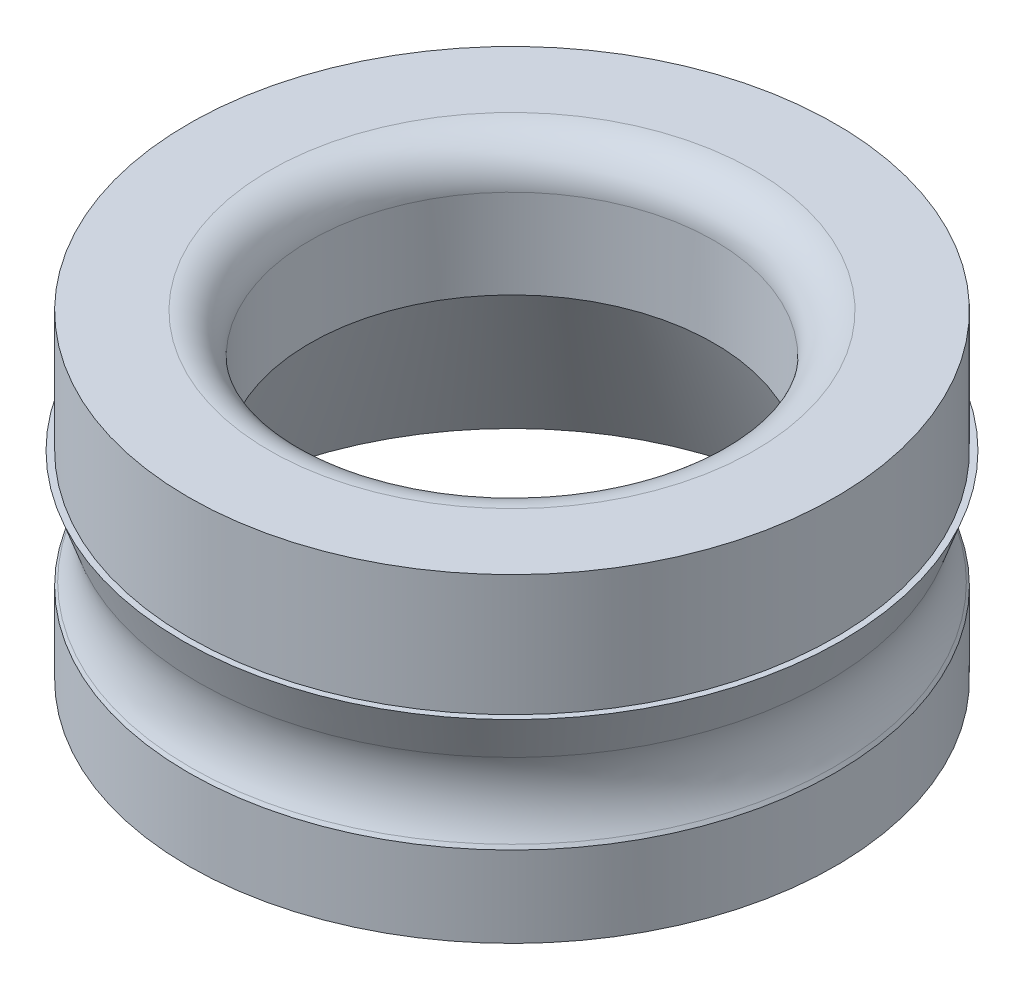
ISO-10303-21;
HEADER;
FILE_DESCRIPTION(('STEP AP214'),'2;1');
FILE_NAME('part.step','',(''),(''),'','','');
FILE_SCHEMA(('AUTOMOTIVE_DESIGN { 1 0 10303 214 1 1 1 1 }'));
ENDSEC;
DATA;
#1=APPLICATION_CONTEXT('core data for automotive mechanical design processes');
#2=APPLICATION_PROTOCOL_DEFINITION('international standard','automotive_design',2000,#1);
#3=PRODUCT_CONTEXT('',#1,'mechanical');
#4=PRODUCT('Part','Part','',(#3));
#5=PRODUCT_RELATED_PRODUCT_CATEGORY('part','',(#4));
#6=PRODUCT_DEFINITION_FORMATION('','',#4);
#7=PRODUCT_DEFINITION_CONTEXT('part definition',#1,'design');
#8=PRODUCT_DEFINITION('design','',#6,#7);
#9=PRODUCT_DEFINITION_SHAPE('','',#8);
#10=(LENGTH_UNIT() NAMED_UNIT(*) SI_UNIT(.MILLI.,.METRE.));
#11=(NAMED_UNIT(*) PLANE_ANGLE_UNIT() SI_UNIT($,.RADIAN.));
#12=(NAMED_UNIT(*) SI_UNIT($,.STERADIAN.) SOLID_ANGLE_UNIT());
#13=UNCERTAINTY_MEASURE_WITH_UNIT(LENGTH_MEASURE(1.E-05),#10,'distance_accuracy_value','');
#14=(GEOMETRIC_REPRESENTATION_CONTEXT(3) GLOBAL_UNCERTAINTY_ASSIGNED_CONTEXT((#13)) GLOBAL_UNIT_ASSIGNED_CONTEXT((#10,
#11,#12)) REPRESENTATION_CONTEXT('',''));
#15=CARTESIAN_POINT('',(0.,0.,0.));
#16=DIRECTION('',(0.,0.,1.));
#17=DIRECTION('',(1.,0.,0.));
#18=AXIS2_PLACEMENT_3D('',#15,#16,#17);
#19=CARTESIAN_POINT('',(0.,0.,0.));
#20=DIRECTION('',(0.,1.,0.));
#21=DIRECTION('',(0.,0.,1.));
#22=AXIS2_PLACEMENT_3D('',#19,#20,#21);
#23=CYLINDRICAL_SURFACE('',#22,2.5);
#24=CARTESIAN_POINT('',(0.,-0.5,0.));
#25=DIRECTION('',(0.,-1.,0.));
#26=DIRECTION('',(0.,0.,-1.));
#27=AXIS2_PLACEMENT_3D('',#24,#25,#26);
#28=CIRCLE('',#27,2.5);
#29=CARTESIAN_POINT('',(0.,-0.5,-2.5));
#30=VERTEX_POINT('',#29);
#31=EDGE_CURVE('E21',#30,#30,#28,.F.);
#32=ORIENTED_EDGE('',*,*,#31,.T.);
#33=EDGE_LOOP('',(#32));
#34=FACE_BOUND('',#33,.T.);
#35=CARTESIAN_POINT('',(0.,-1.6,0.));
#36=DIRECTION('',(0.,1.,0.));
#37=DIRECTION('',(0.,0.,1.));
#38=AXIS2_PLACEMENT_3D('',#35,#36,#37);
#39=CIRCLE('',#38,2.5);
#40=CARTESIAN_POINT('',(0.,-1.6,2.5));
#41=VERTEX_POINT('',#40);
#42=EDGE_CURVE('E56',#41,#41,#39,.T.);
#43=ORIENTED_EDGE('',*,*,#42,.F.);
#44=EDGE_LOOP('',(#43));
#45=FACE_BOUND('',#44,.T.);
#46=ADVANCED_FACE('F14',(#34,#45),#23,.F.);
#47=CARTESIAN_POINT('',(2.5,0.,0.));
#48=DIRECTION('',(0.,-1.,0.));
#49=DIRECTION('',(0.,0.,-1.));
#50=AXIS2_PLACEMENT_3D('',#47,#48,#49);
#51=PLANE('',#50);
#52=CARTESIAN_POINT('',(0.,0.,0.));
#53=DIRECTION('',(0.,-1.,0.));
#54=DIRECTION('',(0.,0.,-1.));
#55=AXIS2_PLACEMENT_3D('',#52,#53,#54);
#56=CIRCLE('',#55,3.);
#57=CARTESIAN_POINT('',(0.,0.,-3.));
#58=VERTEX_POINT('',#57);
#59=EDGE_CURVE('E10',#58,#58,#56,.T.);
#60=ORIENTED_EDGE('',*,*,#59,.T.);
#61=EDGE_LOOP('',(#60));
#62=FACE_BOUND('',#61,.T.);
#63=CARTESIAN_POINT('',(0.,0.,0.));
#64=DIRECTION('',(0.,1.,0.));
#65=DIRECTION('',(0.,0.,1.));
#66=AXIS2_PLACEMENT_3D('',#63,#64,#65);
#67=CIRCLE('',#66,4.);
#68=CARTESIAN_POINT('',(0.,0.,4.));
#69=VERTEX_POINT('',#68);
#70=EDGE_CURVE('E34',#69,#69,#67,.T.);
#71=ORIENTED_EDGE('',*,*,#70,.T.);
#72=EDGE_LOOP('',(#71));
#73=FACE_BOUND('',#72,.T.);
#74=ADVANCED_FACE('F66',(#62,#73),#51,.F.);
#75=CARTESIAN_POINT('',(0.,0.,0.));
#76=DIRECTION('',(0.,1.,0.));
#77=DIRECTION('',(0.,0.,1.));
#78=AXIS2_PLACEMENT_3D('',#75,#76,#77);
#79=CYLINDRICAL_SURFACE('',#78,4.);
#80=ORIENTED_EDGE('',*,*,#70,.F.);
#81=EDGE_LOOP('',(#80));
#82=FACE_BOUND('',#81,.T.);
#83=CARTESIAN_POINT('',(0.,-1.5,0.));
#84=DIRECTION('',(0.,1.,0.));
#85=DIRECTION('',(0.,0.,1.));
#86=AXIS2_PLACEMENT_3D('',#83,#84,#85);
#87=CIRCLE('',#86,4.);
#88=CARTESIAN_POINT('',(0.,-1.5,4.));
#89=VERTEX_POINT('',#88);
#90=EDGE_CURVE('E37',#89,#89,#87,.T.);
#91=ORIENTED_EDGE('',*,*,#90,.T.);
#92=EDGE_LOOP('',(#91));
#93=FACE_BOUND('',#92,.T.);
#94=ADVANCED_FACE('F72',(#82,#93),#79,.T.);
#95=CARTESIAN_POINT('',(4.,-1.5,0.));
#96=DIRECTION('',(0.,-1.,0.));
#97=DIRECTION('',(0.,0.,-1.));
#98=AXIS2_PLACEMENT_3D('',#95,#96,#97);
#99=PLANE('',#98);
#100=ORIENTED_EDGE('',*,*,#90,.F.);
#101=EDGE_LOOP('',(#100));
#102=FACE_BOUND('',#101,.T.);
#103=CARTESIAN_POINT('',(0.,-1.5,0.));
#104=DIRECTION('',(0.,1.,0.));
#105=DIRECTION('',(0.,0.,1.));
#106=AXIS2_PLACEMENT_3D('',#103,#104,#105);
#107=CIRCLE('',#106,4.075);
#108=CARTESIAN_POINT('',(0.,-1.5,4.075));
#109=VERTEX_POINT('',#108);
#110=EDGE_CURVE('E40',#109,#109,#107,.T.);
#111=ORIENTED_EDGE('',*,*,#110,.T.);
#112=EDGE_LOOP('',(#111));
#113=FACE_BOUND('',#112,.T.);
#114=ADVANCED_FACE('F94',(#102,#113),#99,.F.);
#115=CARTESIAN_POINT('',(0.,-2.49698119094872,0.));
#116=DIRECTION('',(0.,1.,0.));
#117=DIRECTION('',(0.,0.,1.));
#118=AXIS2_PLACEMENT_3D('',#115,#116,#117);
#119=CONICAL_SURFACE('',#118,3.71833235537383,0.343560185198722);
#120=CARTESIAN_POINT('',(0.,-2.04225730658908,0.));
#121=DIRECTION('',(0.,1.,0.));
#122=DIRECTION('',(0.,0.,1.));
#123=AXIS2_PLACEMENT_3D('',#120,#121,#122);
#124=CIRCLE('',#123,3.88100874110934);
#125=CARTESIAN_POINT('',(0.,-2.04225730658908,3.88100874110934));
#126=VERTEX_POINT('',#125);
#127=EDGE_CURVE('E29',#126,#126,#124,.T.);
#128=ORIENTED_EDGE('',*,*,#127,.T.);
#129=EDGE_LOOP('',(#128));
#130=FACE_BOUND('',#129,.T.);
#131=ORIENTED_EDGE('',*,*,#110,.F.);
#132=EDGE_LOOP('',(#131));
#133=FACE_BOUND('',#132,.T.);
#134=ADVANCED_FACE('F90',(#130,#133),#119,.T.);
#135=CARTESIAN_POINT('',(0.,-2.95,0.));
#136=DIRECTION('',(0.,-1.,0.));
#137=DIRECTION('',(0.,0.,-1.));
#138=AXIS2_PLACEMENT_3D('',#135,#136,#137);
#139=CONICAL_SURFACE('',#138,4.,0.55626391677816);
#140=CARTESIAN_POINT('',(0.,-2.90711574183858,0.));
#141=DIRECTION('',(0.,-1.,0.));
#142=DIRECTION('',(0.,0.,-1.));
#143=AXIS2_PLACEMENT_3D('',#140,#141,#142);
#144=CIRCLE('',#143,3.97333640955624);
#145=CARTESIAN_POINT('',(0.,-2.90711574183858,-3.97333640955624));
#146=VERTEX_POINT('',#145);
#147=EDGE_CURVE('E25',#146,#146,#144,.T.);
#148=ORIENTED_EDGE('',*,*,#147,.T.);
#149=EDGE_LOOP('',(#148));
#150=FACE_BOUND('',#149,.T.);
#151=CARTESIAN_POINT('',(0.,-2.95,0.));
#152=DIRECTION('',(0.,1.,0.));
#153=DIRECTION('',(0.,0.,1.));
#154=AXIS2_PLACEMENT_3D('',#151,#152,#153);
#155=CIRCLE('',#154,4.);
#156=CARTESIAN_POINT('',(0.,-2.95,4.));
#157=VERTEX_POINT('',#156);
#158=EDGE_CURVE('E43',#157,#157,#155,.T.);
#159=ORIENTED_EDGE('',*,*,#158,.T.);
#160=EDGE_LOOP('',(#159));
#161=FACE_BOUND('',#160,.T.);
#162=ADVANCED_FACE('F93',(#150,#161),#139,.T.);
#163=CARTESIAN_POINT('',(0.,0.,0.));
#164=DIRECTION('',(0.,1.,0.));
#165=DIRECTION('',(0.,0.,1.));
#166=AXIS2_PLACEMENT_3D('',#163,#164,#165);
#167=CYLINDRICAL_SURFACE('',#166,4.);
#168=ORIENTED_EDGE('',*,*,#158,.F.);
#169=EDGE_LOOP('',(#168));
#170=FACE_BOUND('',#169,.T.);
#171=CARTESIAN_POINT('',(0.,-3.95,0.));
#172=DIRECTION('',(0.,1.,0.));
#173=DIRECTION('',(0.,0.,1.));
#174=AXIS2_PLACEMENT_3D('',#171,#172,#173);
#175=CIRCLE('',#174,4.);
#176=CARTESIAN_POINT('',(0.,-3.95,4.));
#177=VERTEX_POINT('',#176);
#178=EDGE_CURVE('E47',#177,#177,#175,.T.);
#179=ORIENTED_EDGE('',*,*,#178,.T.);
#180=EDGE_LOOP('',(#179));
#181=FACE_BOUND('',#180,.T.);
#182=ADVANCED_FACE('F109',(#170,#181),#167,.T.);
#183=CARTESIAN_POINT('',(4.,-3.95,0.));
#184=DIRECTION('',(0.,1.,0.));
#185=DIRECTION('',(0.,0.,1.));
#186=AXIS2_PLACEMENT_3D('',#183,#184,#185);
#187=PLANE('',#186);
#188=ORIENTED_EDGE('',*,*,#178,.F.);
#189=EDGE_LOOP('',(#188));
#190=FACE_BOUND('',#189,.T.);
#191=CARTESIAN_POINT('',(0.,-3.95,0.));
#192=DIRECTION('',(0.,1.,0.));
#193=DIRECTION('',(0.,0.,1.));
#194=AXIS2_PLACEMENT_3D('',#191,#192,#193);
#195=CIRCLE('',#194,3.8);
#196=CARTESIAN_POINT('',(0.,-3.95,3.8));
#197=VERTEX_POINT('',#196);
#198=EDGE_CURVE('E50',#197,#197,#195,.T.);
#199=ORIENTED_EDGE('',*,*,#198,.T.);
#200=EDGE_LOOP('',(#199));
#201=FACE_BOUND('',#200,.T.);
#202=ADVANCED_FACE('F113',(#190,#201),#187,.F.);
#203=CARTESIAN_POINT('',(0.,-1.6,0.));
#204=DIRECTION('',(0.,-1.,0.));
#205=DIRECTION('',(0.,0.,-1.));
#206=AXIS2_PLACEMENT_3D('',#203,#204,#205);
#207=CONICAL_SURFACE('',#206,2.75,0.420196713609275);
#208=ORIENTED_EDGE('',*,*,#198,.F.);
#209=EDGE_LOOP('',(#208));
#210=FACE_BOUND('',#209,.T.);
#211=CARTESIAN_POINT('',(0.,-1.6,0.));
#212=DIRECTION('',(0.,1.,0.));
#213=DIRECTION('',(0.,0.,1.));
#214=AXIS2_PLACEMENT_3D('',#211,#212,#213);
#215=CIRCLE('',#214,2.75);
#216=CARTESIAN_POINT('',(0.,-1.6,2.75));
#217=VERTEX_POINT('',#216);
#218=EDGE_CURVE('E53',#217,#217,#215,.T.);
#219=ORIENTED_EDGE('',*,*,#218,.T.);
#220=EDGE_LOOP('',(#219));
#221=FACE_BOUND('',#220,.T.);
#222=ADVANCED_FACE('F83',(#210,#221),#207,.F.);
#223=CARTESIAN_POINT('',(2.75,-1.6,0.));
#224=DIRECTION('',(0.,1.,0.));
#225=DIRECTION('',(0.,0.,1.));
#226=AXIS2_PLACEMENT_3D('',#223,#224,#225);
#227=PLANE('',#226);
#228=ORIENTED_EDGE('',*,*,#218,.F.);
#229=EDGE_LOOP('',(#228));
#230=FACE_BOUND('',#229,.T.);
#231=ORIENTED_EDGE('',*,*,#42,.T.);
#232=EDGE_LOOP('',(#231));
#233=FACE_BOUND('',#232,.T.);
#234=ADVANCED_FACE('F63',(#230,#233),#227,.F.);
#235=CARTESIAN_POINT('',(0.,-2.37909865938718,0.));
#236=DIRECTION('',(0.,1.,0.));
#237=DIRECTION('',(0.,0.,1.));
#238=AXIS2_PLACEMENT_3D('',#235,#236,#237);
#239=TOROIDAL_SURFACE('',#238,4.82257015867335,1.);
#240=ORIENTED_EDGE('',*,*,#147,.F.);
#241=EDGE_LOOP('',(#240));
#242=FACE_BOUND('',#241,.T.);
#243=ORIENTED_EDGE('',*,*,#127,.F.);
#244=EDGE_LOOP('',(#243));
#245=FACE_BOUND('',#244,.T.);
#246=ADVANCED_FACE('F75',(#242,#245),#239,.F.);
#247=CARTESIAN_POINT('',(0.,-0.5,0.));
#248=DIRECTION('',(0.,-1.,0.));
#249=DIRECTION('',(0.,0.,-1.));
#250=AXIS2_PLACEMENT_3D('',#247,#248,#249);
#251=TOROIDAL_SURFACE('',#250,3.,0.5);
#252=ORIENTED_EDGE('',*,*,#59,.F.);
#253=EDGE_LOOP('',(#252));
#254=FACE_BOUND('',#253,.T.);
#255=ORIENTED_EDGE('',*,*,#31,.F.);
#256=EDGE_LOOP('',(#255));
#257=FACE_BOUND('',#256,.T.);
#258=ADVANCED_FACE('F16',(#254,#257),#251,.T.);
#259=CLOSED_SHELL('',(#46,#74,#94,#114,#134,#162,#182,#202,#222,#234,#246,#258));
#260=MANIFOLD_SOLID_BREP('B1',#259);
#261=ADVANCED_BREP_SHAPE_REPRESENTATION('',(#18,#260),#14);
#262=SHAPE_DEFINITION_REPRESENTATION(#9,#261);
ENDSEC;
END-ISO-10303-21;
